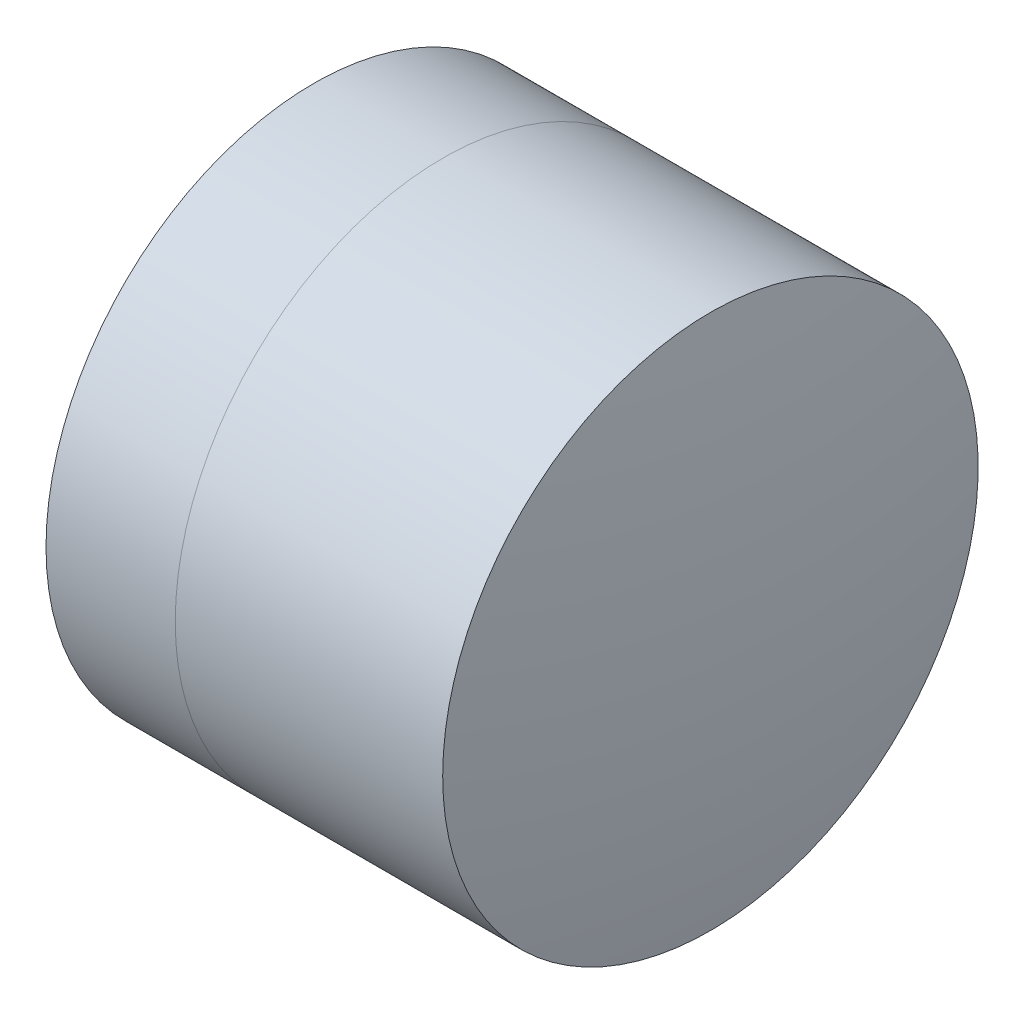
ISO-10303-21;
HEADER;
FILE_DESCRIPTION(('STEP AP214'),'2;1');
FILE_NAME('part.step','',(''),(''),'','','');
FILE_SCHEMA(('AUTOMOTIVE_DESIGN { 1 0 10303 214 1 1 1 1 }'));
ENDSEC;
DATA;
#1=APPLICATION_CONTEXT('core data for automotive mechanical design processes');
#2=APPLICATION_PROTOCOL_DEFINITION('international standard','automotive_design',2000,#1);
#3=PRODUCT_CONTEXT('',#1,'mechanical');
#4=PRODUCT('Part','Part','',(#3));
#5=PRODUCT_RELATED_PRODUCT_CATEGORY('part','',(#4));
#6=PRODUCT_DEFINITION_FORMATION('','',#4);
#7=PRODUCT_DEFINITION_CONTEXT('part definition',#1,'design');
#8=PRODUCT_DEFINITION('design','',#6,#7);
#9=PRODUCT_DEFINITION_SHAPE('','',#8);
#10=(LENGTH_UNIT() NAMED_UNIT(*) SI_UNIT(.MILLI.,.METRE.));
#11=(NAMED_UNIT(*) PLANE_ANGLE_UNIT() SI_UNIT($,.RADIAN.));
#12=(NAMED_UNIT(*) SI_UNIT($,.STERADIAN.) SOLID_ANGLE_UNIT());
#13=UNCERTAINTY_MEASURE_WITH_UNIT(LENGTH_MEASURE(1.E-05),#10,'distance_accuracy_value','');
#14=(GEOMETRIC_REPRESENTATION_CONTEXT(3) GLOBAL_UNCERTAINTY_ASSIGNED_CONTEXT((#13)) GLOBAL_UNIT_ASSIGNED_CONTEXT((#10,
#11,#12)) REPRESENTATION_CONTEXT('',''));
#15=CARTESIAN_POINT('',(0.,0.,0.));
#16=DIRECTION('',(0.,0.,1.));
#17=DIRECTION('',(1.,0.,0.));
#18=AXIS2_PLACEMENT_3D('',#15,#16,#17);
#19=CARTESIAN_POINT('',(0.178214333061158,0.,0.));
#20=DIRECTION('',(-1.,0.,0.));
#21=DIRECTION('',(0.,0.,1.));
#22=AXIS2_PLACEMENT_3D('',#19,#20,#21);
#23=SPHERICAL_SURFACE('',#22,4.3);
#24=CARTESIAN_POINT('',(3.67678546996834,0.,0.));
#25=DIRECTION('',(-1.,0.,0.));
#26=DIRECTION('',(0.,0.,1.));
#27=AXIS2_PLACEMENT_3D('',#24,#25,#26);
#28=CIRCLE('',#27,2.5);
#29=CARTESIAN_POINT('',(3.67678546996834,0.,2.5));
#30=VERTEX_POINT('',#29);
#31=EDGE_CURVE('E11',#30,#30,#28,.T.);
#32=ORIENTED_EDGE('',*,*,#31,.T.);
#33=EDGE_LOOP('',(#32));
#34=FACE_BOUND('',#33,.T.);
#35=ADVANCED_FACE('F45',(#34),#23,.F.);
#36=CARTESIAN_POINT('',(-0.551919992657797,0.,0.));
#37=DIRECTION('',(-1.,0.,0.));
#38=DIRECTION('',(0.,0.,1.));
#39=AXIS2_PLACEMENT_3D('',#36,#37,#38);
#40=CYLINDRICAL_SURFACE('',#39,2.5);
#41=CARTESIAN_POINT('',(6.17393741556039,0.,0.));
#42=DIRECTION('',(-1.,0.,0.));
#43=DIRECTION('',(0.,0.,1.));
#44=AXIS2_PLACEMENT_3D('',#41,#42,#43);
#45=CIRCLE('',#44,2.5);
#46=CARTESIAN_POINT('',(6.17393741556039,0.,2.5));
#47=VERTEX_POINT('',#46);
#48=EDGE_CURVE('E51',#47,#47,#45,.T.);
#49=ORIENTED_EDGE('',*,*,#48,.T.);
#50=EDGE_LOOP('',(#49));
#51=FACE_BOUND('',#50,.T.);
#52=ORIENTED_EDGE('',*,*,#31,.F.);
#53=EDGE_LOOP('',(#52));
#54=FACE_BOUND('',#53,.T.);
#55=ADVANCED_FACE('F57',(#51,#54),#40,.T.);
#56=CARTESIAN_POINT('',(-9.02178566693884,0.,0.));
#57=DIRECTION('',(-1.,0.,0.));
#58=DIRECTION('',(0.,0.,1.));
#59=AXIS2_PLACEMENT_3D('',#56,#57,#58);
#60=SPHERICAL_SURFACE('',#59,15.4);
#61=ORIENTED_EDGE('',*,*,#48,.F.);
#62=EDGE_LOOP('',(#61));
#63=FACE_BOUND('',#62,.T.);
#64=ADVANCED_FACE('F60',(#63),#60,.T.);
#65=CLOSED_SHELL('',(#35,#55,#64));
#66=MANIFOLD_SOLID_BREP('B2',#65);
#67=CARTESIAN_POINT('',(8.57821433306116,0.,0.));
#68=DIRECTION('',(-1.,0.,0.));
#69=DIRECTION('',(0.,0.,1.));
#70=AXIS2_PLACEMENT_3D('',#67,#68,#69);
#71=SPHERICAL_SURFACE('',#70,6.6);
#72=CARTESIAN_POINT('',(2.47002311143098,0.,0.));
#73=DIRECTION('',(-1.,0.,0.));
#74=DIRECTION('',(0.,0.,1.));
#75=AXIS2_PLACEMENT_3D('',#72,#73,#74);
#76=CIRCLE('',#75,2.5);
#77=CARTESIAN_POINT('',(2.47002311143098,0.,2.5));
#78=VERTEX_POINT('',#77);
#79=EDGE_CURVE('E44',#78,#78,#76,.T.);
#80=ORIENTED_EDGE('',*,*,#79,.T.);
#81=EDGE_LOOP('',(#80));
#82=FACE_BOUND('',#81,.T.);
#83=ADVANCED_FACE('F86',(#82),#71,.T.);
#84=CARTESIAN_POINT('',(-0.816062176165804,0.,0.));
#85=DIRECTION('',(-1.,0.,0.));
#86=DIRECTION('',(0.,0.,1.));
#87=AXIS2_PLACEMENT_3D('',#84,#85,#86);
#88=CYLINDRICAL_SURFACE('',#87,2.5);
#89=CARTESIAN_POINT('',(3.67678546996834,0.,0.));
#90=DIRECTION('',(-1.,0.,0.));
#91=DIRECTION('',(0.,0.,1.));
#92=AXIS2_PLACEMENT_3D('',#89,#90,#91);
#93=CIRCLE('',#92,2.5);
#94=CARTESIAN_POINT('',(3.67678546996834,0.,2.5));
#95=VERTEX_POINT('',#94);
#96=EDGE_CURVE('E92',#95,#95,#93,.T.);
#97=ORIENTED_EDGE('',*,*,#96,.T.);
#98=EDGE_LOOP('',(#97));
#99=FACE_BOUND('',#98,.T.);
#100=ORIENTED_EDGE('',*,*,#79,.F.);
#101=EDGE_LOOP('',(#100));
#102=FACE_BOUND('',#101,.T.);
#103=ADVANCED_FACE('F98',(#99,#102),#88,.T.);
#104=CARTESIAN_POINT('',(0.178214333061158,0.,0.));
#105=DIRECTION('',(-1.,0.,0.));
#106=DIRECTION('',(0.,0.,1.));
#107=AXIS2_PLACEMENT_3D('',#104,#105,#106);
#108=SPHERICAL_SURFACE('',#107,4.3);
#109=ORIENTED_EDGE('',*,*,#96,.F.);
#110=EDGE_LOOP('',(#109));
#111=FACE_BOUND('',#110,.T.);
#112=ADVANCED_FACE('F101',(#111),#108,.T.);
#113=CLOSED_SHELL('',(#83,#103,#112));
#114=MANIFOLD_SOLID_BREP('B6',#113);
#115=ADVANCED_BREP_SHAPE_REPRESENTATION('',(#18,#66,#114),#14);
#116=SHAPE_DEFINITION_REPRESENTATION(#9,#115);
ENDSEC;
END-ISO-10303-21;
